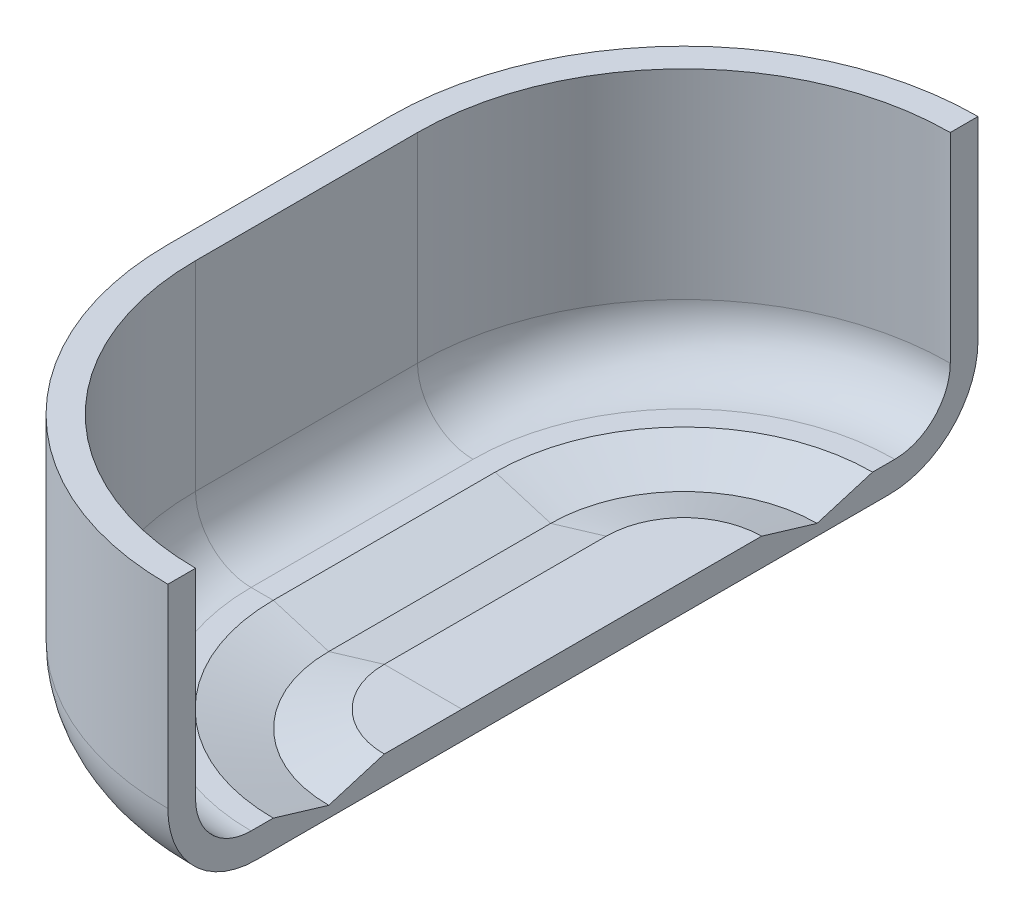
ISO-10303-21;
HEADER;
FILE_DESCRIPTION(('STEP AP214'),'2;1');
FILE_NAME('part.step','',(''),(''),'','','');
FILE_SCHEMA(('AUTOMOTIVE_DESIGN { 1 0 10303 214 1 1 1 1 }'));
ENDSEC;
DATA;
#1=APPLICATION_CONTEXT('core data for automotive mechanical design processes');
#2=APPLICATION_PROTOCOL_DEFINITION('international standard','automotive_design',2000,#1);
#3=PRODUCT_CONTEXT('',#1,'mechanical');
#4=PRODUCT('Part','Part','',(#3));
#5=PRODUCT_RELATED_PRODUCT_CATEGORY('part','',(#4));
#6=PRODUCT_DEFINITION_FORMATION('','',#4);
#7=PRODUCT_DEFINITION_CONTEXT('part definition',#1,'design');
#8=PRODUCT_DEFINITION('design','',#6,#7);
#9=PRODUCT_DEFINITION_SHAPE('','',#8);
#10=(LENGTH_UNIT() NAMED_UNIT(*) SI_UNIT(.MILLI.,.METRE.));
#11=(NAMED_UNIT(*) PLANE_ANGLE_UNIT() SI_UNIT($,.RADIAN.));
#12=(NAMED_UNIT(*) SI_UNIT($,.STERADIAN.) SOLID_ANGLE_UNIT());
#13=UNCERTAINTY_MEASURE_WITH_UNIT(LENGTH_MEASURE(1.E-05),#10,'distance_accuracy_value','');
#14=(GEOMETRIC_REPRESENTATION_CONTEXT(3) GLOBAL_UNCERTAINTY_ASSIGNED_CONTEXT((#13)) GLOBAL_UNIT_ASSIGNED_CONTEXT((#10,
#11,#12)) REPRESENTATION_CONTEXT('',''));
#15=CARTESIAN_POINT('',(0.,0.,0.));
#16=DIRECTION('',(0.,0.,1.));
#17=DIRECTION('',(1.,0.,0.));
#18=AXIS2_PLACEMENT_3D('',#15,#16,#17);
#19=CARTESIAN_POINT('',(4.99999999999998,51.,40.));
#20=DIRECTION('',(0.,-1.,0.));
#21=DIRECTION('',(0.,0.,-1.));
#22=AXIS2_PLACEMENT_3D('',#19,#20,#21);
#23=PLANE('',#22);
#24=DIRECTION('',(0.,0.,-1.));
#25=VECTOR('',#24,1.);
#26=CARTESIAN_POINT('',(4.99999999999998,51.,40.));
#27=LINE('',#26,#25);
#28=CARTESIAN_POINT('',(4.99999999999998,51.,40.));
#29=VERTEX_POINT('',#28);
#30=CARTESIAN_POINT('',(4.99999999999998,51.,0.));
#31=VERTEX_POINT('',#30);
#32=EDGE_CURVE('E174',#29,#31,#27,.T.);
#33=ORIENTED_EDGE('',*,*,#32,.T.);
#34=CARTESIAN_POINT('',(53.,51.,0.));
#35=DIRECTION('',(0.,-1.,0.));
#36=DIRECTION('',(-1.,0.,0.));
#37=AXIS2_PLACEMENT_3D('',#34,#35,#36);
#38=CIRCLE('',#37,48.);
#39=CARTESIAN_POINT('',(53.,51.,-48.));
#40=VERTEX_POINT('',#39);
#41=EDGE_CURVE('E199',#31,#40,#38,.T.);
#42=ORIENTED_EDGE('',*,*,#41,.T.);
#43=DIRECTION('',(0.,0.,1.));
#44=VECTOR('',#43,1.);
#45=CARTESIAN_POINT('',(53.,51.,-53.));
#46=LINE('',#45,#44);
#47=CARTESIAN_POINT('',(53.,51.,-53.));
#48=VERTEX_POINT('',#47);
#49=EDGE_CURVE('E197',#48,#40,#46,.T.);
#50=ORIENTED_EDGE('',*,*,#49,.F.);
#51=CARTESIAN_POINT('',(53.,51.,0.));
#52=DIRECTION('',(0.,-1.,0.));
#53=DIRECTION('',(-1.,0.,0.));
#54=AXIS2_PLACEMENT_3D('',#51,#52,#53);
#55=CIRCLE('',#54,53.);
#56=CARTESIAN_POINT('',(0.,51.,0.));
#57=VERTEX_POINT('',#56);
#58=EDGE_CURVE('E194',#57,#48,#55,.T.);
#59=ORIENTED_EDGE('',*,*,#58,.F.);
#60=DIRECTION('',(0.,0.,-1.));
#61=VECTOR('',#60,1.);
#62=CARTESIAN_POINT('',(0.,51.,40.));
#63=LINE('',#62,#61);
#64=CARTESIAN_POINT('',(0.,51.,40.));
#65=VERTEX_POINT('',#64);
#66=EDGE_CURVE('E173',#65,#57,#63,.T.);
#67=ORIENTED_EDGE('',*,*,#66,.F.);
#68=CARTESIAN_POINT('',(53.,51.,40.));
#69=DIRECTION('',(0.,1.,0.));
#70=DIRECTION('',(-1.,0.,0.));
#71=AXIS2_PLACEMENT_3D('',#68,#69,#70);
#72=CIRCLE('',#71,53.);
#73=CARTESIAN_POINT('',(53.,51.,93.));
#74=VERTEX_POINT('',#73);
#75=EDGE_CURVE('E285',#65,#74,#72,.T.);
#76=ORIENTED_EDGE('',*,*,#75,.T.);
#77=DIRECTION('',(0.,0.,1.));
#78=VECTOR('',#77,1.);
#79=CARTESIAN_POINT('',(53.,51.,88.));
#80=LINE('',#79,#78);
#81=CARTESIAN_POINT('',(53.,51.,88.));
#82=VERTEX_POINT('',#81);
#83=EDGE_CURVE('E283',#82,#74,#80,.T.);
#84=ORIENTED_EDGE('',*,*,#83,.F.);
#85=CARTESIAN_POINT('',(53.,51.,40.));
#86=DIRECTION('',(0.,1.,0.));
#87=DIRECTION('',(-1.,0.,0.));
#88=AXIS2_PLACEMENT_3D('',#85,#86,#87);
#89=CIRCLE('',#88,48.);
#90=EDGE_CURVE('E280',#29,#82,#89,.T.);
#91=ORIENTED_EDGE('',*,*,#90,.F.);
#92=EDGE_LOOP('',(#33,#42,#50,#59,#67,#76,#84,#91));
#93=FACE_BOUND('',#92,.T.);
#94=ADVANCED_FACE('F32',(#93),#23,.F.);
#95=CARTESIAN_POINT('',(0.,51.,40.));
#96=DIRECTION('',(1.,0.,0.));
#97=DIRECTION('',(0.,1.,0.));
#98=AXIS2_PLACEMENT_3D('',#95,#96,#97);
#99=PLANE('',#98);
#100=DIRECTION('',(0.,-1.,0.));
#101=VECTOR('',#100,1.);
#102=CARTESIAN_POINT('',(0.,51.,0.));
#103=LINE('',#102,#101);
#104=CARTESIAN_POINT('',(0.,16.,0.));
#105=VERTEX_POINT('',#104);
#106=EDGE_CURVE('E290',#57,#105,#103,.T.);
#107=ORIENTED_EDGE('',*,*,#106,.T.);
#108=DIRECTION('',(0.,0.,-1.));
#109=VECTOR('',#108,1.);
#110=CARTESIAN_POINT('',(0.,16.,40.));
#111=LINE('',#110,#109);
#112=CARTESIAN_POINT('',(0.,16.,40.));
#113=VERTEX_POINT('',#112);
#114=EDGE_CURVE('E311',#105,#113,#111,.F.);
#115=ORIENTED_EDGE('',*,*,#114,.T.);
#116=DIRECTION('',(0.,-1.,0.));
#117=VECTOR('',#116,1.);
#118=CARTESIAN_POINT('',(0.,51.,40.));
#119=LINE('',#118,#117);
#120=EDGE_CURVE('E291',#65,#113,#119,.T.);
#121=ORIENTED_EDGE('',*,*,#120,.F.);
#122=ORIENTED_EDGE('',*,*,#66,.T.);
#123=EDGE_LOOP('',(#107,#115,#121,#122));
#124=FACE_BOUND('',#123,.T.);
#125=ADVANCED_FACE('F399',(#124),#99,.F.);
#126=CARTESIAN_POINT('',(0.,0.,40.));
#127=DIRECTION('',(0.,1.,0.));
#128=DIRECTION('',(0.,0.,1.));
#129=AXIS2_PLACEMENT_3D('',#126,#127,#128);
#130=PLANE('',#129);
#131=DIRECTION('',(0.,0.,-1.));
#132=VECTOR('',#131,1.);
#133=CARTESIAN_POINT('',(53.,0.,40.));
#134=LINE('',#133,#132);
#135=CARTESIAN_POINT('',(53.,0.,77.));
#136=VERTEX_POINT('',#135);
#137=CARTESIAN_POINT('',(53.,0.,-37.));
#138=VERTEX_POINT('',#137);
#139=EDGE_CURVE('E163',#136,#138,#134,.T.);
#140=ORIENTED_EDGE('',*,*,#139,.F.);
#141=CARTESIAN_POINT('',(53.,0.,40.));
#142=DIRECTION('',(0.,1.,0.));
#143=DIRECTION('',(0.,0.,1.));
#144=AXIS2_PLACEMENT_3D('',#141,#142,#143);
#145=CIRCLE('',#144,37.);
#146=CARTESIAN_POINT('',(16.,0.,40.));
#147=VERTEX_POINT('',#146);
#148=EDGE_CURVE('E307',#136,#147,#145,.F.);
#149=ORIENTED_EDGE('',*,*,#148,.T.);
#150=DIRECTION('',(0.,0.,-1.));
#151=VECTOR('',#150,1.);
#152=CARTESIAN_POINT('',(16.,0.,40.));
#153=LINE('',#152,#151);
#154=CARTESIAN_POINT('',(16.,0.,0.));
#155=VERTEX_POINT('',#154);
#156=EDGE_CURVE('E187',#147,#155,#153,.T.);
#157=ORIENTED_EDGE('',*,*,#156,.T.);
#158=CARTESIAN_POINT('',(53.,0.,0.));
#159=DIRECTION('',(0.,-1.,0.));
#160=DIRECTION('',(-1.,0.,0.));
#161=AXIS2_PLACEMENT_3D('',#158,#159,#160);
#162=CIRCLE('',#161,37.);
#163=EDGE_CURVE('E181',#155,#138,#162,.T.);
#164=ORIENTED_EDGE('',*,*,#163,.T.);
#165=EDGE_LOOP('',(#140,#149,#157,#164));
#166=FACE_BOUND('',#165,.T.);
#167=ADVANCED_FACE('F185',(#166),#130,.F.);
#168=CARTESIAN_POINT('',(53.,0.,40.));
#169=DIRECTION('',(-1.,0.,0.));
#170=DIRECTION('',(0.,0.,1.));
#171=AXIS2_PLACEMENT_3D('',#168,#169,#170);
#172=PLANE('',#171);
#173=DIRECTION('',(0.,0.,-1.));
#174=VECTOR('',#173,1.);
#175=CARTESIAN_POINT('',(53.,5.,40.));
#176=LINE('',#175,#174);
#177=CARTESIAN_POINT('',(53.,5.,54.));
#178=VERTEX_POINT('',#177);
#179=CARTESIAN_POINT('',(53.,5.,40.));
#180=VERTEX_POINT('',#179);
#181=EDGE_CURVE('E235',#178,#180,#176,.T.);
#182=ORIENTED_EDGE('',*,*,#181,.F.);
#183=DIRECTION('',(0.,0.287347885566345,-0.957826285221152));
#184=VECTOR('',#183,1.);
#185=CARTESIAN_POINT('',(53.,5.,54.));
#186=LINE('',#185,#184);
#187=CARTESIAN_POINT('',(53.,2.00000000000001,64.));
#188=VERTEX_POINT('',#187);
#189=EDGE_CURVE('E246',#188,#178,#186,.T.);
#190=ORIENTED_EDGE('',*,*,#189,.F.);
#191=DIRECTION('',(0.,-0.287347885566345,-0.957826285221151));
#192=VECTOR('',#191,1.);
#193=CARTESIAN_POINT('',(53.,5.00000000000001,74.));
#194=LINE('',#193,#192);
#195=CARTESIAN_POINT('',(53.,5.00000000000001,74.));
#196=VERTEX_POINT('',#195);
#197=EDGE_CURVE('E230',#196,#188,#194,.T.);
#198=ORIENTED_EDGE('',*,*,#197,.F.);
#199=DIRECTION('',(0.,0.,-1.));
#200=VECTOR('',#199,1.);
#201=CARTESIAN_POINT('',(53.,5.00000000000001,88.));
#202=LINE('',#201,#200);
#203=CARTESIAN_POINT('',(53.,5.00000000000001,78.));
#204=VERTEX_POINT('',#203);
#205=EDGE_CURVE('E228',#204,#196,#202,.T.);
#206=ORIENTED_EDGE('',*,*,#205,.F.);
#207=CARTESIAN_POINT('',(53.,15.,78.));
#208=DIRECTION('',(-1.,0.,0.));
#209=DIRECTION('',(0.,0.,1.));
#210=AXIS2_PLACEMENT_3D('',#207,#208,#209);
#211=CIRCLE('',#210,10.);
#212=CARTESIAN_POINT('',(53.,15.,88.));
#213=VERTEX_POINT('',#212);
#214=EDGE_CURVE('E41',#204,#213,#211,.T.);
#215=ORIENTED_EDGE('',*,*,#214,.T.);
#216=DIRECTION('',(0.,1.,0.));
#217=VECTOR('',#216,1.);
#218=CARTESIAN_POINT('',(53.,0.999999999999995,88.));
#219=LINE('',#218,#217);
#220=EDGE_CURVE('E277',#213,#82,#219,.T.);
#221=ORIENTED_EDGE('',*,*,#220,.T.);
#222=ORIENTED_EDGE('',*,*,#83,.T.);
#223=DIRECTION('',(0.,-1.,0.));
#224=VECTOR('',#223,1.);
#225=CARTESIAN_POINT('',(53.,51.,93.));
#226=LINE('',#225,#224);
#227=CARTESIAN_POINT('',(53.,16.,93.));
#228=VERTEX_POINT('',#227);
#229=EDGE_CURVE('E288',#74,#228,#226,.T.);
#230=ORIENTED_EDGE('',*,*,#229,.T.);
#231=CARTESIAN_POINT('',(53.,16.,77.));
#232=DIRECTION('',(-1.,0.,0.));
#233=DIRECTION('',(0.,0.,1.));
#234=AXIS2_PLACEMENT_3D('',#231,#232,#233);
#235=CIRCLE('',#234,16.);
#236=EDGE_CURVE('E169',#228,#136,#235,.F.);
#237=ORIENTED_EDGE('',*,*,#236,.T.);
#238=ORIENTED_EDGE('',*,*,#139,.T.);
#239=CARTESIAN_POINT('',(53.,16.,-37.));
#240=DIRECTION('',(1.,0.,0.));
#241=DIRECTION('',(0.,0.,-1.));
#242=AXIS2_PLACEMENT_3D('',#239,#240,#241);
#243=CIRCLE('',#242,16.);
#244=CARTESIAN_POINT('',(53.,16.,-53.));
#245=VERTEX_POINT('',#244);
#246=EDGE_CURVE('E167',#138,#245,#243,.T.);
#247=ORIENTED_EDGE('',*,*,#246,.T.);
#248=DIRECTION('',(0.,1.,0.));
#249=VECTOR('',#248,1.);
#250=CARTESIAN_POINT('',(53.,16.,-53.));
#251=LINE('',#250,#249);
#252=EDGE_CURVE('E192',#245,#48,#251,.T.);
#253=ORIENTED_EDGE('',*,*,#252,.T.);
#254=ORIENTED_EDGE('',*,*,#49,.T.);
#255=DIRECTION('',(0.,-1.,0.));
#256=VECTOR('',#255,1.);
#257=CARTESIAN_POINT('',(53.,51.,-48.));
#258=LINE('',#257,#256);
#259=CARTESIAN_POINT('',(53.,15.,-48.));
#260=VERTEX_POINT('',#259);
#261=EDGE_CURVE('E202',#40,#260,#258,.T.);
#262=ORIENTED_EDGE('',*,*,#261,.T.);
#263=CARTESIAN_POINT('',(53.,15.,-38.));
#264=DIRECTION('',(-1.,0.,0.));
#265=DIRECTION('',(0.,0.,-1.));
#266=AXIS2_PLACEMENT_3D('',#263,#264,#265);
#267=CIRCLE('',#266,10.);
#268=CARTESIAN_POINT('',(53.,5.00000000000001,-38.));
#269=VERTEX_POINT('',#268);
#270=EDGE_CURVE('E207',#260,#269,#267,.T.);
#271=ORIENTED_EDGE('',*,*,#270,.T.);
#272=DIRECTION('',(0.,0.,1.));
#273=VECTOR('',#272,1.);
#274=CARTESIAN_POINT('',(53.,5.00000000000001,-38.));
#275=LINE('',#274,#273);
#276=CARTESIAN_POINT('',(53.,5.,-34.));
#277=VERTEX_POINT('',#276);
#278=EDGE_CURVE('E212',#269,#277,#275,.T.);
#279=ORIENTED_EDGE('',*,*,#278,.T.);
#280=DIRECTION('',(0.,-0.287347885566345,0.957826285221151));
#281=VECTOR('',#280,1.);
#282=CARTESIAN_POINT('',(53.,5.,-34.));
#283=LINE('',#282,#281);
#284=CARTESIAN_POINT('',(53.,2.,-24.));
#285=VERTEX_POINT('',#284);
#286=EDGE_CURVE('E217',#277,#285,#283,.T.);
#287=ORIENTED_EDGE('',*,*,#286,.T.);
#288=DIRECTION('',(0.,0.287347885566345,0.957826285221152));
#289=VECTOR('',#288,1.);
#290=CARTESIAN_POINT('',(53.,2.,-24.));
#291=LINE('',#290,#289);
#292=CARTESIAN_POINT('',(53.,5.,-14.));
#293=VERTEX_POINT('',#292);
#294=EDGE_CURVE('E222',#285,#293,#291,.T.);
#295=ORIENTED_EDGE('',*,*,#294,.T.);
#296=DIRECTION('',(0.,0.,-1.));
#297=VECTOR('',#296,1.);
#298=CARTESIAN_POINT('',(53.,5.,40.));
#299=LINE('',#298,#297);
#300=EDGE_CURVE('E271',#180,#293,#299,.T.);
#301=ORIENTED_EDGE('',*,*,#300,.F.);
#302=EDGE_LOOP('',(#182,#190,#198,#206,#215,#221,#222,#230,#237,#238,#247,#253,#254,#262,#271,
#279,#287,#295,#301));
#303=FACE_BOUND('',#302,.T.);
#304=ADVANCED_FACE('F166',(#303),#172,.F.);
#305=CARTESIAN_POINT('',(4.99999999999999,0.999999999999988,40.));
#306=DIRECTION('',(-1.,0.,0.));
#307=DIRECTION('',(0.,-1.,0.));
#308=AXIS2_PLACEMENT_3D('',#305,#306,#307);
#309=PLANE('',#308);
#310=DIRECTION('',(0.,1.,0.));
#311=VECTOR('',#310,1.);
#312=CARTESIAN_POINT('',(4.99999999999999,0.999999999999988,40.));
#313=LINE('',#312,#311);
#314=CARTESIAN_POINT('',(4.99999999999999,15.,40.));
#315=VERTEX_POINT('',#314);
#316=EDGE_CURVE('E294',#315,#29,#313,.T.);
#317=ORIENTED_EDGE('',*,*,#316,.F.);
#318=DIRECTION('',(0.,0.,-1.));
#319=VECTOR('',#318,1.);
#320=CARTESIAN_POINT('',(4.99999999999999,15.,40.));
#321=LINE('',#320,#319);
#322=CARTESIAN_POINT('',(4.99999999999999,15.,0.));
#323=VERTEX_POINT('',#322);
#324=EDGE_CURVE('E55',#315,#323,#321,.T.);
#325=ORIENTED_EDGE('',*,*,#324,.T.);
#326=DIRECTION('',(0.,1.,0.));
#327=VECTOR('',#326,1.);
#328=CARTESIAN_POINT('',(4.99999999999999,0.999999999999988,0.));
#329=LINE('',#328,#327);
#330=EDGE_CURVE('E295',#323,#31,#329,.T.);
#331=ORIENTED_EDGE('',*,*,#330,.T.);
#332=ORIENTED_EDGE('',*,*,#32,.F.);
#333=EDGE_LOOP('',(#317,#325,#331,#332));
#334=FACE_BOUND('',#333,.T.);
#335=ADVANCED_FACE('F391',(#334),#309,.F.);
#336=CARTESIAN_POINT('',(53.,0.999999999999994,40.));
#337=DIRECTION('',(0.,1.,0.));
#338=DIRECTION('',(-1.,0.,0.));
#339=AXIS2_PLACEMENT_3D('',#336,#337,#338);
#340=CYLINDRICAL_SURFACE('',#339,48.);
#341=ORIENTED_EDGE('',*,*,#220,.F.);
#342=CARTESIAN_POINT('',(53.,15.,40.));
#343=DIRECTION('',(0.,1.,0.));
#344=DIRECTION('',(-1.,0.,0.));
#345=AXIS2_PLACEMENT_3D('',#342,#343,#344);
#346=CIRCLE('',#345,48.);
#347=EDGE_CURVE('E313',#213,#315,#346,.F.);
#348=ORIENTED_EDGE('',*,*,#347,.T.);
#349=ORIENTED_EDGE('',*,*,#316,.T.);
#350=ORIENTED_EDGE('',*,*,#90,.T.);
#351=EDGE_LOOP('',(#341,#348,#349,#350));
#352=FACE_BOUND('',#351,.T.);
#353=ADVANCED_FACE('F331',(#352),#340,.F.);
#354=CARTESIAN_POINT('',(53.,0.999999999999994,40.));
#355=DIRECTION('',(0.,1.,0.));
#356=DIRECTION('',(-1.,0.,0.));
#357=AXIS2_PLACEMENT_3D('',#354,#355,#356);
#358=CYLINDRICAL_SURFACE('',#357,53.);
#359=ORIENTED_EDGE('',*,*,#120,.T.);
#360=CARTESIAN_POINT('',(53.,16.,40.));
#361=DIRECTION('',(0.,1.,0.));
#362=DIRECTION('',(0.,0.,1.));
#363=AXIS2_PLACEMENT_3D('',#360,#361,#362);
#364=CIRCLE('',#363,53.);
#365=EDGE_CURVE('E302',#113,#228,#364,.T.);
#366=ORIENTED_EDGE('',*,*,#365,.T.);
#367=ORIENTED_EDGE('',*,*,#229,.F.);
#368=ORIENTED_EDGE('',*,*,#75,.F.);
#369=EDGE_LOOP('',(#359,#366,#367,#368));
#370=FACE_BOUND('',#369,.T.);
#371=ADVANCED_FACE('F381',(#370),#358,.T.);
#372=CARTESIAN_POINT('',(53.,5.00000000000001,88.));
#373=DIRECTION('',(0.,1.,0.));
#374=DIRECTION('',(-1.,0.,0.));
#375=AXIS2_PLACEMENT_3D('',#372,#373,#374);
#376=PLANE('',#375);
#377=DIRECTION('',(1.,0.,0.));
#378=VECTOR('',#377,1.);
#379=CARTESIAN_POINT('',(5.,5.00000000000001,40.));
#380=LINE('',#379,#378);
#381=CARTESIAN_POINT('',(15.,5.,40.));
#382=VERTEX_POINT('',#381);
#383=CARTESIAN_POINT('',(19.,5.,40.));
#384=VERTEX_POINT('',#383);
#385=EDGE_CURVE('E232',#382,#384,#380,.T.);
#386=ORIENTED_EDGE('',*,*,#385,.F.);
#387=CARTESIAN_POINT('',(53.,5.00000000000001,40.));
#388=DIRECTION('',(0.,1.,0.));
#389=DIRECTION('',(-1.,0.,0.));
#390=AXIS2_PLACEMENT_3D('',#387,#388,#389);
#391=CIRCLE('',#390,38.);
#392=EDGE_CURVE('E318',#382,#204,#391,.T.);
#393=ORIENTED_EDGE('',*,*,#392,.T.);
#394=ORIENTED_EDGE('',*,*,#205,.T.);
#395=CARTESIAN_POINT('',(53.,5.00000000000001,40.));
#396=DIRECTION('',(0.,-1.,0.));
#397=DIRECTION('',(0.,0.,1.));
#398=AXIS2_PLACEMENT_3D('',#395,#396,#397);
#399=CIRCLE('',#398,34.);
#400=EDGE_CURVE('E234',#196,#384,#399,.T.);
#401=ORIENTED_EDGE('',*,*,#400,.T.);
#402=EDGE_LOOP('',(#386,#393,#394,#401));
#403=FACE_BOUND('',#402,.T.);
#404=ADVANCED_FACE('F379',(#403),#376,.T.);
#405=CARTESIAN_POINT('',(53.,5.00000000000001,40.));
#406=DIRECTION('',(0.,1.,0.));
#407=DIRECTION('',(-1.,0.,0.));
#408=AXIS2_PLACEMENT_3D('',#405,#406,#407);
#409=CONICAL_SURFACE('',#408,34.,1.27933953231703);
#410=CARTESIAN_POINT('',(53.,2.00000000000001,40.));
#411=DIRECTION('',(0.,-1.,0.));
#412=DIRECTION('',(0.,0.,1.));
#413=AXIS2_PLACEMENT_3D('',#410,#411,#412);
#414=CIRCLE('',#413,24.);
#415=CARTESIAN_POINT('',(29.,2.,40.));
#416=VERTEX_POINT('',#415);
#417=EDGE_CURVE('E249',#188,#416,#414,.T.);
#418=ORIENTED_EDGE('',*,*,#417,.T.);
#419=DIRECTION('',(0.957826285221151,-0.287347885566345,0.));
#420=VECTOR('',#419,1.);
#421=CARTESIAN_POINT('',(19.,5.,40.));
#422=LINE('',#421,#420);
#423=EDGE_CURVE('E238',#384,#416,#422,.T.);
#424=ORIENTED_EDGE('',*,*,#423,.F.);
#425=ORIENTED_EDGE('',*,*,#400,.F.);
#426=ORIENTED_EDGE('',*,*,#197,.T.);
#427=EDGE_LOOP('',(#418,#424,#425,#426));
#428=FACE_BOUND('',#427,.T.);
#429=ADVANCED_FACE('F376',(#428),#409,.F.);
#430=CARTESIAN_POINT('',(53.,2.00000000000001,40.));
#431=DIRECTION('',(0.,-1.,0.));
#432=DIRECTION('',(1.,0.,0.));
#433=AXIS2_PLACEMENT_3D('',#430,#431,#432);
#434=CONICAL_SURFACE('',#433,24.,1.27933953231703);
#435=CARTESIAN_POINT('',(53.,5.,40.));
#436=DIRECTION('',(0.,-1.,0.));
#437=DIRECTION('',(0.,0.,1.));
#438=AXIS2_PLACEMENT_3D('',#435,#436,#437);
#439=CIRCLE('',#438,14.);
#440=CARTESIAN_POINT('',(39.,5.,40.));
#441=VERTEX_POINT('',#440);
#442=EDGE_CURVE('E263',#178,#441,#439,.T.);
#443=ORIENTED_EDGE('',*,*,#442,.T.);
#444=DIRECTION('',(0.957826285221152,0.287347885566345,0.));
#445=VECTOR('',#444,1.);
#446=CARTESIAN_POINT('',(39.,5.,40.));
#447=LINE('',#446,#445);
#448=EDGE_CURVE('E252',#416,#441,#447,.T.);
#449=ORIENTED_EDGE('',*,*,#448,.F.);
#450=ORIENTED_EDGE('',*,*,#417,.F.);
#451=ORIENTED_EDGE('',*,*,#189,.T.);
#452=EDGE_LOOP('',(#443,#449,#450,#451));
#453=FACE_BOUND('',#452,.T.);
#454=ADVANCED_FACE('F367',(#453),#434,.T.);
#455=CARTESIAN_POINT('',(53.,5.,40.));
#456=DIRECTION('',(0.,1.,0.));
#457=DIRECTION('',(-1.,0.,0.));
#458=AXIS2_PLACEMENT_3D('',#455,#456,#457);
#459=PLANE('',#458);
#460=ORIENTED_EDGE('',*,*,#181,.T.);
#461=DIRECTION('',(1.,0.,0.));
#462=VECTOR('',#461,1.);
#463=CARTESIAN_POINT('',(53.,5.,40.));
#464=LINE('',#463,#462);
#465=EDGE_CURVE('E266',#441,#180,#464,.T.);
#466=ORIENTED_EDGE('',*,*,#465,.F.);
#467=ORIENTED_EDGE('',*,*,#442,.F.);
#468=EDGE_LOOP('',(#460,#466,#467));
#469=FACE_BOUND('',#468,.T.);
#470=ADVANCED_FACE('F364',(#469),#459,.T.);
#471=CARTESIAN_POINT('',(5.,5.00000000000001,40.));
#472=DIRECTION('',(0.,1.,0.));
#473=DIRECTION('',(-1.,0.,0.));
#474=AXIS2_PLACEMENT_3D('',#471,#472,#473);
#475=PLANE('',#474);
#476=DIRECTION('',(0.,0.,-1.));
#477=VECTOR('',#476,1.);
#478=CARTESIAN_POINT('',(19.,5.,40.));
#479=LINE('',#478,#477);
#480=CARTESIAN_POINT('',(19.,5.,0.));
#481=VERTEX_POINT('',#480);
#482=EDGE_CURVE('E239',#384,#481,#479,.T.);
#483=ORIENTED_EDGE('',*,*,#482,.T.);
#484=CARTESIAN_POINT('',(53.,5.,0.));
#485=DIRECTION('',(0.,-1.,0.));
#486=DIRECTION('',(-1.,0.,0.));
#487=AXIS2_PLACEMENT_3D('',#484,#485,#486);
#488=CIRCLE('',#487,34.);
#489=EDGE_CURVE('E214',#481,#277,#488,.T.);
#490=ORIENTED_EDGE('',*,*,#489,.T.);
#491=ORIENTED_EDGE('',*,*,#278,.F.);
#492=CARTESIAN_POINT('',(53.,5.00000000000001,0.));
#493=DIRECTION('',(0.,-1.,0.));
#494=DIRECTION('',(-1.,0.,0.));
#495=AXIS2_PLACEMENT_3D('',#492,#493,#494);
#496=CIRCLE('',#495,38.);
#497=CARTESIAN_POINT('',(15.,5.,0.));
#498=VERTEX_POINT('',#497);
#499=EDGE_CURVE('E209',#498,#269,#496,.T.);
#500=ORIENTED_EDGE('',*,*,#499,.F.);
#501=DIRECTION('',(0.,0.,-1.));
#502=VECTOR('',#501,1.);
#503=CARTESIAN_POINT('',(15.,5.,40.));
#504=LINE('',#503,#502);
#505=EDGE_CURVE('E48',#498,#382,#504,.F.);
#506=ORIENTED_EDGE('',*,*,#505,.T.);
#507=ORIENTED_EDGE('',*,*,#385,.T.);
#508=EDGE_LOOP('',(#483,#490,#491,#500,#506,#507));
#509=FACE_BOUND('',#508,.T.);
#510=ADVANCED_FACE('F348',(#509),#475,.T.);
#511=CARTESIAN_POINT('',(19.,5.,40.));
#512=DIRECTION('',(0.287347885566345,0.957826285221152,0.));
#513=DIRECTION('',(-0.957826285221152,0.287347885566345,0.));
#514=AXIS2_PLACEMENT_3D('',#511,#512,#513);
#515=PLANE('',#514);
#516=DIRECTION('',(0.,0.,-1.));
#517=VECTOR('',#516,1.);
#518=CARTESIAN_POINT('',(29.,2.,40.));
#519=LINE('',#518,#517);
#520=CARTESIAN_POINT('',(29.,2.,0.));
#521=VERTEX_POINT('',#520);
#522=EDGE_CURVE('E255',#416,#521,#519,.T.);
#523=ORIENTED_EDGE('',*,*,#522,.T.);
#524=DIRECTION('',(0.957826285221151,-0.287347885566345,0.));
#525=VECTOR('',#524,1.);
#526=CARTESIAN_POINT('',(19.,5.,0.));
#527=LINE('',#526,#525);
#528=EDGE_CURVE('E242',#481,#521,#527,.T.);
#529=ORIENTED_EDGE('',*,*,#528,.F.);
#530=ORIENTED_EDGE('',*,*,#482,.F.);
#531=ORIENTED_EDGE('',*,*,#423,.T.);
#532=EDGE_LOOP('',(#523,#529,#530,#531));
#533=FACE_BOUND('',#532,.T.);
#534=ADVANCED_FACE('F372',(#533),#515,.T.);
#535=CARTESIAN_POINT('',(39.,5.,40.));
#536=DIRECTION('',(-0.287347885566345,0.957826285221152,0.));
#537=DIRECTION('',(-0.957826285221152,-0.287347885566345,0.));
#538=AXIS2_PLACEMENT_3D('',#535,#536,#537);
#539=PLANE('',#538);
#540=DIRECTION('',(0.,0.,-1.));
#541=VECTOR('',#540,1.);
#542=CARTESIAN_POINT('',(39.,5.,40.));
#543=LINE('',#542,#541);
#544=CARTESIAN_POINT('',(39.,5.,0.));
#545=VERTEX_POINT('',#544);
#546=EDGE_CURVE('E269',#441,#545,#543,.T.);
#547=ORIENTED_EDGE('',*,*,#546,.T.);
#548=DIRECTION('',(0.957826285221152,0.287347885566345,0.));
#549=VECTOR('',#548,1.);
#550=CARTESIAN_POINT('',(39.,5.,0.));
#551=LINE('',#550,#549);
#552=EDGE_CURVE('E258',#521,#545,#551,.T.);
#553=ORIENTED_EDGE('',*,*,#552,.F.);
#554=ORIENTED_EDGE('',*,*,#522,.F.);
#555=ORIENTED_EDGE('',*,*,#448,.T.);
#556=EDGE_LOOP('',(#547,#553,#554,#555));
#557=FACE_BOUND('',#556,.T.);
#558=ADVANCED_FACE('F370',(#557),#539,.T.);
#559=CARTESIAN_POINT('',(53.,5.,40.));
#560=DIRECTION('',(0.,1.,0.));
#561=DIRECTION('',(0.,0.,1.));
#562=AXIS2_PLACEMENT_3D('',#559,#560,#561);
#563=PLANE('',#562);
#564=ORIENTED_EDGE('',*,*,#300,.T.);
#565=CARTESIAN_POINT('',(53.,5.,0.));
#566=DIRECTION('',(0.,-1.,0.));
#567=DIRECTION('',(-1.,0.,0.));
#568=AXIS2_PLACEMENT_3D('',#565,#566,#567);
#569=CIRCLE('',#568,14.);
#570=EDGE_CURVE('E225',#545,#293,#569,.T.);
#571=ORIENTED_EDGE('',*,*,#570,.F.);
#572=ORIENTED_EDGE('',*,*,#546,.F.);
#573=ORIENTED_EDGE('',*,*,#465,.T.);
#574=EDGE_LOOP('',(#564,#571,#572,#573));
#575=FACE_BOUND('',#574,.T.);
#576=ADVANCED_FACE('F360',(#575),#563,.T.);
#577=CARTESIAN_POINT('',(16.,16.,40.));
#578=DIRECTION('',(0.,0.,-1.));
#579=DIRECTION('',(-1.,0.,0.));
#580=AXIS2_PLACEMENT_3D('',#577,#578,#579);
#581=CYLINDRICAL_SURFACE('',#580,16.);
#582=CARTESIAN_POINT('',(16.,16.,0.));
#583=DIRECTION('',(0.,0.,1.));
#584=DIRECTION('',(1.,0.,0.));
#585=AXIS2_PLACEMENT_3D('',#582,#583,#584);
#586=CIRCLE('',#585,16.);
#587=EDGE_CURVE('E309',#155,#105,#586,.F.);
#588=ORIENTED_EDGE('',*,*,#587,.F.);
#589=ORIENTED_EDGE('',*,*,#156,.F.);
#590=CARTESIAN_POINT('',(16.,16.,40.));
#591=DIRECTION('',(0.,0.,1.));
#592=DIRECTION('',(1.,0.,0.));
#593=AXIS2_PLACEMENT_3D('',#590,#591,#592);
#594=CIRCLE('',#593,16.);
#595=EDGE_CURVE('E231',#113,#147,#594,.T.);
#596=ORIENTED_EDGE('',*,*,#595,.F.);
#597=ORIENTED_EDGE('',*,*,#114,.F.);
#598=EDGE_LOOP('',(#588,#589,#596,#597));
#599=FACE_BOUND('',#598,.T.);
#600=ADVANCED_FACE('F383',(#599),#581,.T.);
#601=CARTESIAN_POINT('',(53.,16.,40.));
#602=DIRECTION('',(0.,1.,0.));
#603=DIRECTION('',(0.,0.,1.));
#604=AXIS2_PLACEMENT_3D('',#601,#602,#603);
#605=TOROIDAL_SURFACE('',#604,37.,16.);
#606=ORIENTED_EDGE('',*,*,#595,.T.);
#607=ORIENTED_EDGE('',*,*,#148,.F.);
#608=ORIENTED_EDGE('',*,*,#236,.F.);
#609=ORIENTED_EDGE('',*,*,#365,.F.);
#610=EDGE_LOOP('',(#606,#607,#608,#609));
#611=FACE_BOUND('',#610,.T.);
#612=ADVANCED_FACE('F395',(#611),#605,.T.);
#613=CARTESIAN_POINT('',(15.,15.,40.));
#614=DIRECTION('',(0.,0.,-1.));
#615=DIRECTION('',(0.,1.,0.));
#616=AXIS2_PLACEMENT_3D('',#613,#614,#615);
#617=CYLINDRICAL_SURFACE('',#616,10.);
#618=CARTESIAN_POINT('',(15.,15.,0.));
#619=DIRECTION('',(0.,0.,1.));
#620=DIRECTION('',(1.,0.,0.));
#621=AXIS2_PLACEMENT_3D('',#618,#619,#620);
#622=CIRCLE('',#621,10.);
#623=EDGE_CURVE('E11',#323,#498,#622,.T.);
#624=ORIENTED_EDGE('',*,*,#623,.F.);
#625=ORIENTED_EDGE('',*,*,#324,.F.);
#626=CARTESIAN_POINT('',(15.,15.,40.));
#627=DIRECTION('',(0.,0.,-1.));
#628=DIRECTION('',(-1.,0.,0.));
#629=AXIS2_PLACEMENT_3D('',#626,#627,#628);
#630=CIRCLE('',#629,10.);
#631=EDGE_CURVE('E36',#382,#315,#630,.T.);
#632=ORIENTED_EDGE('',*,*,#631,.F.);
#633=ORIENTED_EDGE('',*,*,#505,.F.);
#634=EDGE_LOOP('',(#624,#625,#632,#633));
#635=FACE_BOUND('',#634,.T.);
#636=ADVANCED_FACE('F34',(#635),#617,.F.);
#637=CARTESIAN_POINT('',(53.,15.,40.));
#638=DIRECTION('',(0.,1.,0.));
#639=DIRECTION('',(-1.,0.,0.));
#640=AXIS2_PLACEMENT_3D('',#637,#638,#639);
#641=TOROIDAL_SURFACE('',#640,38.,10.);
#642=ORIENTED_EDGE('',*,*,#214,.F.);
#643=ORIENTED_EDGE('',*,*,#392,.F.);
#644=ORIENTED_EDGE('',*,*,#631,.T.);
#645=ORIENTED_EDGE('',*,*,#347,.F.);
#646=EDGE_LOOP('',(#642,#643,#644,#645));
#647=FACE_BOUND('',#646,.T.);
#648=ADVANCED_FACE('F333',(#647),#641,.F.);
#649=CARTESIAN_POINT('',(53.,16.,0.));
#650=DIRECTION('',(0.,-1.,0.));
#651=DIRECTION('',(0.,0.,-1.));
#652=AXIS2_PLACEMENT_3D('',#649,#650,#651);
#653=TOROIDAL_SURFACE('',#652,37.,16.);
#654=CARTESIAN_POINT('',(53.,16.,0.));
#655=DIRECTION('',(0.,-1.,0.));
#656=DIRECTION('',(-1.,0.,0.));
#657=AXIS2_PLACEMENT_3D('',#654,#655,#656);
#658=CIRCLE('',#657,53.);
#659=EDGE_CURVE('E183',#105,#245,#658,.T.);
#660=ORIENTED_EDGE('',*,*,#659,.T.);
#661=ORIENTED_EDGE('',*,*,#246,.F.);
#662=ORIENTED_EDGE('',*,*,#163,.F.);
#663=ORIENTED_EDGE('',*,*,#587,.T.);
#664=EDGE_LOOP('',(#660,#661,#662,#663));
#665=FACE_BOUND('',#664,.T.);
#666=ADVANCED_FACE('F179',(#665),#653,.T.);
#667=CARTESIAN_POINT('',(53.,5.,0.));
#668=DIRECTION('',(0.,-1.,0.));
#669=DIRECTION('',(0.,0.,-1.));
#670=AXIS2_PLACEMENT_3D('',#667,#668,#669);
#671=CYLINDRICAL_SURFACE('',#670,53.);
#672=ORIENTED_EDGE('',*,*,#58,.T.);
#673=ORIENTED_EDGE('',*,*,#252,.F.);
#674=ORIENTED_EDGE('',*,*,#659,.F.);
#675=ORIENTED_EDGE('',*,*,#106,.F.);
#676=EDGE_LOOP('',(#672,#673,#674,#675));
#677=FACE_BOUND('',#676,.T.);
#678=ADVANCED_FACE('F416',(#677),#671,.T.);
#679=CARTESIAN_POINT('',(53.,5.,0.));
#680=DIRECTION('',(0.,-1.,0.));
#681=DIRECTION('',(0.,0.,-1.));
#682=AXIS2_PLACEMENT_3D('',#679,#680,#681);
#683=CYLINDRICAL_SURFACE('',#682,48.);
#684=CARTESIAN_POINT('',(53.,15.,0.));
#685=DIRECTION('',(0.,-1.,0.));
#686=DIRECTION('',(-1.,0.,0.));
#687=AXIS2_PLACEMENT_3D('',#684,#685,#686);
#688=CIRCLE('',#687,48.);
#689=EDGE_CURVE('E204',#323,#260,#688,.T.);
#690=ORIENTED_EDGE('',*,*,#689,.T.);
#691=ORIENTED_EDGE('',*,*,#261,.F.);
#692=ORIENTED_EDGE('',*,*,#41,.F.);
#693=ORIENTED_EDGE('',*,*,#330,.F.);
#694=EDGE_LOOP('',(#690,#691,#692,#693));
#695=FACE_BOUND('',#694,.T.);
#696=ADVANCED_FACE('F340',(#695),#683,.F.);
#697=CARTESIAN_POINT('',(53.,15.,0.));
#698=DIRECTION('',(0.,-1.,0.));
#699=DIRECTION('',(0.,0.,-1.));
#700=AXIS2_PLACEMENT_3D('',#697,#698,#699);
#701=TOROIDAL_SURFACE('',#700,38.,10.);
#702=ORIENTED_EDGE('',*,*,#499,.T.);
#703=ORIENTED_EDGE('',*,*,#270,.F.);
#704=ORIENTED_EDGE('',*,*,#689,.F.);
#705=ORIENTED_EDGE('',*,*,#623,.T.);
#706=EDGE_LOOP('',(#702,#703,#704,#705));
#707=FACE_BOUND('',#706,.T.);
#708=ADVANCED_FACE('F344',(#707),#701,.F.);
#709=CARTESIAN_POINT('',(53.,5.,0.));
#710=DIRECTION('',(0.,1.,0.));
#711=DIRECTION('',(0.,0.,1.));
#712=AXIS2_PLACEMENT_3D('',#709,#710,#711);
#713=CONICAL_SURFACE('',#712,34.,1.27933953231703);
#714=CARTESIAN_POINT('',(53.,2.,0.));
#715=DIRECTION('',(0.,-1.,0.));
#716=DIRECTION('',(-1.,0.,0.));
#717=AXIS2_PLACEMENT_3D('',#714,#715,#716);
#718=CIRCLE('',#717,24.);
#719=EDGE_CURVE('E219',#521,#285,#718,.T.);
#720=ORIENTED_EDGE('',*,*,#719,.T.);
#721=ORIENTED_EDGE('',*,*,#286,.F.);
#722=ORIENTED_EDGE('',*,*,#489,.F.);
#723=ORIENTED_EDGE('',*,*,#528,.T.);
#724=EDGE_LOOP('',(#720,#721,#722,#723));
#725=FACE_BOUND('',#724,.T.);
#726=ADVANCED_FACE('F352',(#725),#713,.F.);
#727=CARTESIAN_POINT('',(53.,2.,0.));
#728=DIRECTION('',(0.,-1.,0.));
#729=DIRECTION('',(0.,0.,-1.));
#730=AXIS2_PLACEMENT_3D('',#727,#728,#729);
#731=CONICAL_SURFACE('',#730,24.,1.27933953231703);
#732=ORIENTED_EDGE('',*,*,#570,.T.);
#733=ORIENTED_EDGE('',*,*,#294,.F.);
#734=ORIENTED_EDGE('',*,*,#719,.F.);
#735=ORIENTED_EDGE('',*,*,#552,.T.);
#736=EDGE_LOOP('',(#732,#733,#734,#735));
#737=FACE_BOUND('',#736,.T.);
#738=ADVANCED_FACE('F357',(#737),#731,.T.);
#739=CLOSED_SHELL('',(#94,#125,#167,#304,#335,#353,#371,#404,#429,#454,#470,#510,#534,#558,#576,
#600,#612,#636,#648,#666,#678,#696,#708,#726,#738));
#740=MANIFOLD_SOLID_BREP('B2',#739);
#741=ADVANCED_BREP_SHAPE_REPRESENTATION('',(#18,#740),#14);
#742=SHAPE_DEFINITION_REPRESENTATION(#9,#741);
ENDSEC;
END-ISO-10303-21;
